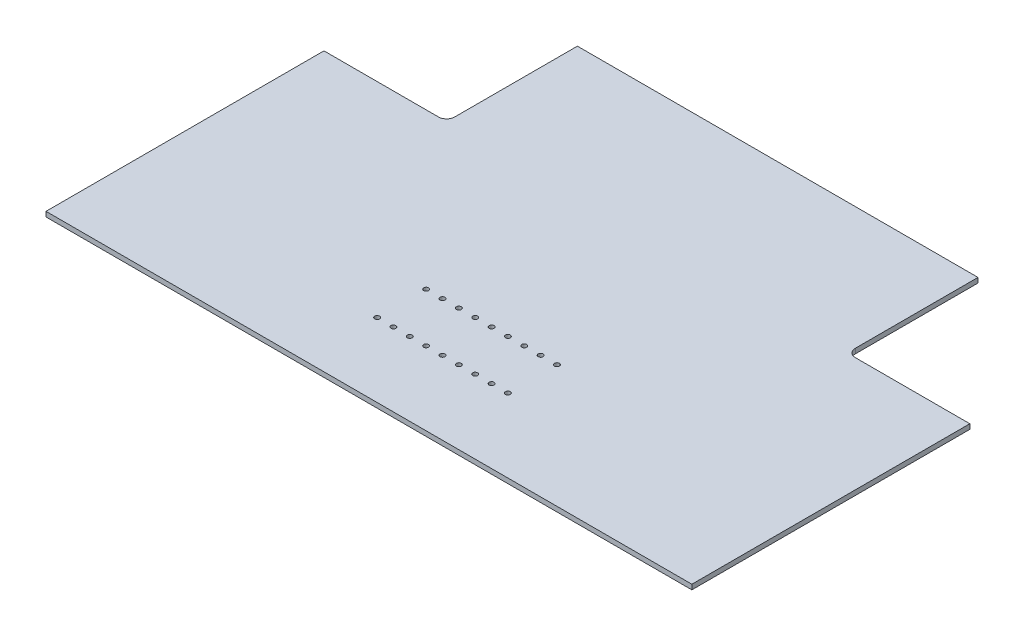
ISO-10303-21;
HEADER;
FILE_DESCRIPTION(('STEP AP214'),'2;1');
FILE_NAME('part.step','',(''),(''),'','','');
FILE_SCHEMA(('AUTOMOTIVE_DESIGN { 1 0 10303 214 1 1 1 1 }'));
ENDSEC;
DATA;
#1=APPLICATION_CONTEXT('core data for automotive mechanical design processes');
#2=APPLICATION_PROTOCOL_DEFINITION('international standard','automotive_design',2000,#1);
#3=PRODUCT_CONTEXT('',#1,'mechanical');
#4=PRODUCT('Part','Part','',(#3));
#5=PRODUCT_RELATED_PRODUCT_CATEGORY('part','',(#4));
#6=PRODUCT_DEFINITION_FORMATION('','',#4);
#7=PRODUCT_DEFINITION_CONTEXT('part definition',#1,'design');
#8=PRODUCT_DEFINITION('design','',#6,#7);
#9=PRODUCT_DEFINITION_SHAPE('','',#8);
#10=(LENGTH_UNIT() NAMED_UNIT(*) SI_UNIT(.MILLI.,.METRE.));
#11=(NAMED_UNIT(*) PLANE_ANGLE_UNIT() SI_UNIT($,.RADIAN.));
#12=(NAMED_UNIT(*) SI_UNIT($,.STERADIAN.) SOLID_ANGLE_UNIT());
#13=UNCERTAINTY_MEASURE_WITH_UNIT(LENGTH_MEASURE(1.E-05),#10,'distance_accuracy_value','');
#14=(GEOMETRIC_REPRESENTATION_CONTEXT(3) GLOBAL_UNCERTAINTY_ASSIGNED_CONTEXT((#13)) GLOBAL_UNIT_ASSIGNED_CONTEXT((#10,
#11,#12)) REPRESENTATION_CONTEXT('',''));
#15=CARTESIAN_POINT('',(0.,0.,0.));
#16=DIRECTION('',(0.,0.,1.));
#17=DIRECTION('',(1.,0.,0.));
#18=AXIS2_PLACEMENT_3D('',#15,#16,#17);
#19=CARTESIAN_POINT('',(197.5,3.,-125.));
#20=DIRECTION('',(-1.,0.,0.));
#21=DIRECTION('',(0.,0.,1.));
#22=AXIS2_PLACEMENT_3D('',#19,#20,#21);
#23=PLANE('',#22);
#24=DIRECTION('',(0.,1.,0.));
#25=VECTOR('',#24,1.);
#26=CARTESIAN_POINT('',(197.5,0.,-45.));
#27=LINE('',#26,#25);
#28=CARTESIAN_POINT('',(197.5,0.,-45.));
#29=VERTEX_POINT('',#28);
#30=CARTESIAN_POINT('',(197.5,3.,-45.));
#31=VERTEX_POINT('',#30);
#32=EDGE_CURVE('E137',#29,#31,#27,.T.);
#33=ORIENTED_EDGE('',*,*,#32,.T.);
#34=DIRECTION('',(0.,0.,-1.));
#35=VECTOR('',#34,1.);
#36=CARTESIAN_POINT('',(197.5,3.,-125.));
#37=LINE('',#36,#35);
#38=CARTESIAN_POINT('',(197.5,3.,125.));
#39=VERTEX_POINT('',#38);
#40=EDGE_CURVE('E158',#39,#31,#37,.T.);
#41=ORIENTED_EDGE('',*,*,#40,.F.);
#42=DIRECTION('',(0.,-1.,0.));
#43=VECTOR('',#42,1.);
#44=CARTESIAN_POINT('',(197.5,3.,125.));
#45=LINE('',#44,#43);
#46=CARTESIAN_POINT('',(197.5,0.,125.));
#47=VERTEX_POINT('',#46);
#48=EDGE_CURVE('E159',#39,#47,#45,.T.);
#49=ORIENTED_EDGE('',*,*,#48,.T.);
#50=DIRECTION('',(0.,0.,-1.));
#51=VECTOR('',#50,1.);
#52=CARTESIAN_POINT('',(197.5,0.,-125.));
#53=LINE('',#52,#51);
#54=EDGE_CURVE('E145',#47,#29,#53,.T.);
#55=ORIENTED_EDGE('',*,*,#54,.T.);
#56=EDGE_LOOP('',(#33,#41,#49,#55));
#57=FACE_BOUND('',#56,.T.);
#58=ADVANCED_FACE('F42',(#57),#23,.F.);
#59=CARTESIAN_POINT('',(-197.5,3.,-125.));
#60=DIRECTION('',(0.,0.,1.));
#61=DIRECTION('',(1.,0.,0.));
#62=AXIS2_PLACEMENT_3D('',#59,#60,#61);
#63=PLANE('',#62);
#64=DIRECTION('',(0.,1.,0.));
#65=VECTOR('',#64,1.);
#66=CARTESIAN_POINT('',(122.5,0.,-125.));
#67=LINE('',#66,#65);
#68=CARTESIAN_POINT('',(122.5,0.,-125.));
#69=VERTEX_POINT('',#68);
#70=CARTESIAN_POINT('',(122.5,3.,-125.));
#71=VERTEX_POINT('',#70);
#72=EDGE_CURVE('E119',#69,#71,#67,.T.);
#73=ORIENTED_EDGE('',*,*,#72,.F.);
#74=DIRECTION('',(-1.,0.,0.));
#75=VECTOR('',#74,1.);
#76=CARTESIAN_POINT('',(-197.5,0.,-125.));
#77=LINE('',#76,#75);
#78=CARTESIAN_POINT('',(-122.5,0.,-125.));
#79=VERTEX_POINT('',#78);
#80=EDGE_CURVE('E132',#69,#79,#77,.T.);
#81=ORIENTED_EDGE('',*,*,#80,.T.);
#82=DIRECTION('',(0.,1.,0.));
#83=VECTOR('',#82,1.);
#84=CARTESIAN_POINT('',(-122.5,0.,-125.));
#85=LINE('',#84,#83);
#86=CARTESIAN_POINT('',(-122.5,3.,-125.));
#87=VERTEX_POINT('',#86);
#88=EDGE_CURVE('E152',#79,#87,#85,.T.);
#89=ORIENTED_EDGE('',*,*,#88,.T.);
#90=DIRECTION('',(-1.,0.,0.));
#91=VECTOR('',#90,1.);
#92=CARTESIAN_POINT('',(-197.5,3.,-125.));
#93=LINE('',#92,#91);
#94=EDGE_CURVE('E135',#71,#87,#93,.T.);
#95=ORIENTED_EDGE('',*,*,#94,.F.);
#96=EDGE_LOOP('',(#73,#81,#89,#95));
#97=FACE_BOUND('',#96,.T.);
#98=ADVANCED_FACE('F130',(#97),#63,.F.);
#99=CARTESIAN_POINT('',(0.,3.,0.));
#100=DIRECTION('',(0.,1.,0.));
#101=DIRECTION('',(0.,0.,1.));
#102=AXIS2_PLACEMENT_3D('',#99,#100,#101);
#103=PLANE('',#102);
#104=CARTESIAN_POINT('',(10.,3.,80.));
#105=DIRECTION('',(0.,1.,0.));
#106=DIRECTION('',(0.,0.,1.));
#107=AXIS2_PLACEMENT_3D('',#104,#105,#106);
#108=CIRCLE('',#107,1.5);
#109=CARTESIAN_POINT('',(10.,3.,81.5));
#110=VERTEX_POINT('',#109);
#111=EDGE_CURVE('E337',#110,#110,#108,.T.);
#112=ORIENTED_EDGE('',*,*,#111,.F.);
#113=EDGE_LOOP('',(#112));
#114=FACE_BOUND('',#113,.T.);
#115=CARTESIAN_POINT('',(-40.,3.,80.));
#116=DIRECTION('',(0.,1.,0.));
#117=DIRECTION('',(0.,0.,1.));
#118=AXIS2_PLACEMENT_3D('',#115,#116,#117);
#119=CIRCLE('',#118,1.5);
#120=CARTESIAN_POINT('',(-40.,3.,81.5));
#121=VERTEX_POINT('',#120);
#122=EDGE_CURVE('E336',#121,#121,#119,.T.);
#123=ORIENTED_EDGE('',*,*,#122,.F.);
#124=EDGE_LOOP('',(#123));
#125=FACE_BOUND('',#124,.T.);
#126=CARTESIAN_POINT('',(-30.,3.,80.));
#127=DIRECTION('',(0.,1.,0.));
#128=DIRECTION('',(0.,0.,1.));
#129=AXIS2_PLACEMENT_3D('',#126,#127,#128);
#130=CIRCLE('',#129,1.5);
#131=CARTESIAN_POINT('',(-30.,3.,81.5));
#132=VERTEX_POINT('',#131);
#133=EDGE_CURVE('E321',#132,#132,#130,.T.);
#134=ORIENTED_EDGE('',*,*,#133,.F.);
#135=EDGE_LOOP('',(#134));
#136=FACE_BOUND('',#135,.T.);
#137=CARTESIAN_POINT('',(-20.,3.,80.));
#138=DIRECTION('',(0.,1.,0.));
#139=DIRECTION('',(0.,0.,1.));
#140=AXIS2_PLACEMENT_3D('',#137,#138,#139);
#141=CIRCLE('',#140,1.5);
#142=CARTESIAN_POINT('',(-20.,3.,81.5));
#143=VERTEX_POINT('',#142);
#144=EDGE_CURVE('E320',#143,#143,#141,.T.);
#145=ORIENTED_EDGE('',*,*,#144,.F.);
#146=EDGE_LOOP('',(#145));
#147=FACE_BOUND('',#146,.T.);
#148=CARTESIAN_POINT('',(20.,3.,80.));
#149=DIRECTION('',(0.,1.,0.));
#150=DIRECTION('',(0.,0.,1.));
#151=AXIS2_PLACEMENT_3D('',#148,#149,#150);
#152=CIRCLE('',#151,1.5);
#153=CARTESIAN_POINT('',(20.,3.,81.5));
#154=VERTEX_POINT('',#153);
#155=EDGE_CURVE('E361',#154,#154,#152,.T.);
#156=ORIENTED_EDGE('',*,*,#155,.F.);
#157=EDGE_LOOP('',(#156));
#158=FACE_BOUND('',#157,.T.);
#159=CARTESIAN_POINT('',(30.,3.,80.));
#160=DIRECTION('',(0.,1.,0.));
#161=DIRECTION('',(0.,0.,1.));
#162=AXIS2_PLACEMENT_3D('',#159,#160,#161);
#163=CIRCLE('',#162,1.5);
#164=CARTESIAN_POINT('',(30.,3.,81.5));
#165=VERTEX_POINT('',#164);
#166=EDGE_CURVE('E352',#165,#165,#163,.T.);
#167=ORIENTED_EDGE('',*,*,#166,.F.);
#168=EDGE_LOOP('',(#167));
#169=FACE_BOUND('',#168,.T.);
#170=CARTESIAN_POINT('',(40.,3.,80.));
#171=DIRECTION('',(0.,1.,0.));
#172=DIRECTION('',(0.,0.,1.));
#173=AXIS2_PLACEMENT_3D('',#170,#171,#172);
#174=CIRCLE('',#173,1.5);
#175=CARTESIAN_POINT('',(40.,3.,81.5));
#176=VERTEX_POINT('',#175);
#177=EDGE_CURVE('E353',#176,#176,#174,.T.);
#178=ORIENTED_EDGE('',*,*,#177,.F.);
#179=EDGE_LOOP('',(#178));
#180=FACE_BOUND('',#179,.T.);
#181=CARTESIAN_POINT('',(-10.,3.,80.));
#182=DIRECTION('',(0.,1.,0.));
#183=DIRECTION('',(0.,0.,1.));
#184=AXIS2_PLACEMENT_3D('',#181,#182,#183);
#185=CIRCLE('',#184,1.5);
#186=CARTESIAN_POINT('',(-10.,3.,81.5));
#187=VERTEX_POINT('',#186);
#188=EDGE_CURVE('E311',#187,#187,#185,.T.);
#189=ORIENTED_EDGE('',*,*,#188,.F.);
#190=EDGE_LOOP('',(#189));
#191=FACE_BOUND('',#190,.T.);
#192=CARTESIAN_POINT('',(10.,3.,50.));
#193=DIRECTION('',(0.,1.,0.));
#194=DIRECTION('',(0.,0.,1.));
#195=AXIS2_PLACEMENT_3D('',#192,#193,#194);
#196=CIRCLE('',#195,1.5);
#197=CARTESIAN_POINT('',(10.,3.,51.5));
#198=VERTEX_POINT('',#197);
#199=EDGE_CURVE('E273',#198,#198,#196,.T.);
#200=ORIENTED_EDGE('',*,*,#199,.F.);
#201=EDGE_LOOP('',(#200));
#202=FACE_BOUND('',#201,.T.);
#203=CARTESIAN_POINT('',(-40.,3.,50.));
#204=DIRECTION('',(0.,1.,0.));
#205=DIRECTION('',(0.,0.,1.));
#206=AXIS2_PLACEMENT_3D('',#203,#204,#205);
#207=CIRCLE('',#206,1.5);
#208=CARTESIAN_POINT('',(-40.,3.,51.5));
#209=VERTEX_POINT('',#208);
#210=EDGE_CURVE('E272',#209,#209,#207,.T.);
#211=ORIENTED_EDGE('',*,*,#210,.F.);
#212=EDGE_LOOP('',(#211));
#213=FACE_BOUND('',#212,.T.);
#214=CARTESIAN_POINT('',(-30.,3.,50.));
#215=DIRECTION('',(0.,1.,0.));
#216=DIRECTION('',(0.,0.,1.));
#217=AXIS2_PLACEMENT_3D('',#214,#215,#216);
#218=CIRCLE('',#217,1.5);
#219=CARTESIAN_POINT('',(-30.,3.,51.5));
#220=VERTEX_POINT('',#219);
#221=EDGE_CURVE('E257',#220,#220,#218,.T.);
#222=ORIENTED_EDGE('',*,*,#221,.F.);
#223=EDGE_LOOP('',(#222));
#224=FACE_BOUND('',#223,.T.);
#225=CARTESIAN_POINT('',(-20.,3.,50.));
#226=DIRECTION('',(0.,1.,0.));
#227=DIRECTION('',(0.,0.,1.));
#228=AXIS2_PLACEMENT_3D('',#225,#226,#227);
#229=CIRCLE('',#228,1.5);
#230=CARTESIAN_POINT('',(-20.,3.,51.5));
#231=VERTEX_POINT('',#230);
#232=EDGE_CURVE('E256',#231,#231,#229,.T.);
#233=ORIENTED_EDGE('',*,*,#232,.F.);
#234=EDGE_LOOP('',(#233));
#235=FACE_BOUND('',#234,.T.);
#236=CARTESIAN_POINT('',(20.,3.,50.));
#237=DIRECTION('',(0.,1.,0.));
#238=DIRECTION('',(0.,0.,1.));
#239=AXIS2_PLACEMENT_3D('',#236,#237,#238);
#240=CIRCLE('',#239,1.5);
#241=CARTESIAN_POINT('',(20.,3.,51.5));
#242=VERTEX_POINT('',#241);
#243=EDGE_CURVE('E298',#242,#242,#240,.T.);
#244=ORIENTED_EDGE('',*,*,#243,.F.);
#245=EDGE_LOOP('',(#244));
#246=FACE_BOUND('',#245,.T.);
#247=CARTESIAN_POINT('',(30.,3.,50.));
#248=DIRECTION('',(0.,1.,0.));
#249=DIRECTION('',(0.,0.,1.));
#250=AXIS2_PLACEMENT_3D('',#247,#248,#249);
#251=CIRCLE('',#250,1.5);
#252=CARTESIAN_POINT('',(30.,3.,51.5));
#253=VERTEX_POINT('',#252);
#254=EDGE_CURVE('E288',#253,#253,#251,.T.);
#255=ORIENTED_EDGE('',*,*,#254,.F.);
#256=EDGE_LOOP('',(#255));
#257=FACE_BOUND('',#256,.T.);
#258=CARTESIAN_POINT('',(40.,3.,50.));
#259=DIRECTION('',(0.,1.,0.));
#260=DIRECTION('',(0.,0.,1.));
#261=AXIS2_PLACEMENT_3D('',#258,#259,#260);
#262=CIRCLE('',#261,1.5);
#263=CARTESIAN_POINT('',(40.,3.,51.5));
#264=VERTEX_POINT('',#263);
#265=EDGE_CURVE('E289',#264,#264,#262,.T.);
#266=ORIENTED_EDGE('',*,*,#265,.F.);
#267=EDGE_LOOP('',(#266));
#268=FACE_BOUND('',#267,.T.);
#269=CARTESIAN_POINT('',(-10.,3.,50.));
#270=DIRECTION('',(0.,1.,0.));
#271=DIRECTION('',(0.,0.,1.));
#272=AXIS2_PLACEMENT_3D('',#269,#270,#271);
#273=CIRCLE('',#272,1.5);
#274=CARTESIAN_POINT('',(-10.,3.,51.5));
#275=VERTEX_POINT('',#274);
#276=EDGE_CURVE('E247',#275,#275,#273,.T.);
#277=ORIENTED_EDGE('',*,*,#276,.F.);
#278=EDGE_LOOP('',(#277));
#279=FACE_BOUND('',#278,.T.);
#280=CARTESIAN_POINT('',(0.,3.,50.));
#281=DIRECTION('',(0.,1.,0.));
#282=DIRECTION('',(0.,0.,1.));
#283=AXIS2_PLACEMENT_3D('',#280,#281,#282);
#284=CIRCLE('',#283,1.5);
#285=CARTESIAN_POINT('',(0.,3.,51.5));
#286=VERTEX_POINT('',#285);
#287=EDGE_CURVE('E174',#286,#286,#284,.T.);
#288=ORIENTED_EDGE('',*,*,#287,.F.);
#289=EDGE_LOOP('',(#288));
#290=FACE_BOUND('',#289,.T.);
#291=CARTESIAN_POINT('',(0.,3.,80.));
#292=DIRECTION('',(0.,1.,0.));
#293=DIRECTION('',(0.,0.,1.));
#294=AXIS2_PLACEMENT_3D('',#291,#292,#293);
#295=CIRCLE('',#294,1.5);
#296=CARTESIAN_POINT('',(0.,3.,81.5));
#297=VERTEX_POINT('',#296);
#298=EDGE_CURVE('E236',#297,#297,#295,.T.);
#299=ORIENTED_EDGE('',*,*,#298,.F.);
#300=EDGE_LOOP('',(#299));
#301=FACE_BOUND('',#300,.T.);
#302=ORIENTED_EDGE('',*,*,#40,.T.);
#303=DIRECTION('',(-1.,0.,0.));
#304=VECTOR('',#303,1.);
#305=CARTESIAN_POINT('',(197.5,3.,-45.));
#306=LINE('',#305,#304);
#307=CARTESIAN_POINT('',(127.5,3.,-45.));
#308=VERTEX_POINT('',#307);
#309=EDGE_CURVE('E126',#31,#308,#306,.T.);
#310=ORIENTED_EDGE('',*,*,#309,.T.);
#311=CARTESIAN_POINT('',(127.5,3.,-50.));
#312=DIRECTION('',(0.,1.,0.));
#313=DIRECTION('',(0.,0.,1.));
#314=AXIS2_PLACEMENT_3D('',#311,#312,#313);
#315=CIRCLE('',#314,5.);
#316=CARTESIAN_POINT('',(122.5,3.,-50.));
#317=VERTEX_POINT('',#316);
#318=EDGE_CURVE('E51',#308,#317,#315,.F.);
#319=ORIENTED_EDGE('',*,*,#318,.T.);
#320=DIRECTION('',(0.,0.,-1.));
#321=VECTOR('',#320,1.);
#322=CARTESIAN_POINT('',(122.5,3.,-125.));
#323=LINE('',#322,#321);
#324=EDGE_CURVE('E178',#317,#71,#323,.T.);
#325=ORIENTED_EDGE('',*,*,#324,.T.);
#326=ORIENTED_EDGE('',*,*,#94,.T.);
#327=DIRECTION('',(0.,0.,-1.));
#328=VECTOR('',#327,1.);
#329=CARTESIAN_POINT('',(-122.5,3.,-125.));
#330=LINE('',#329,#328);
#331=CARTESIAN_POINT('',(-122.5,3.,-50.));
#332=VERTEX_POINT('',#331);
#333=EDGE_CURVE('E213',#332,#87,#330,.T.);
#334=ORIENTED_EDGE('',*,*,#333,.F.);
#335=CARTESIAN_POINT('',(-127.5,3.,-50.));
#336=DIRECTION('',(0.,1.,0.));
#337=DIRECTION('',(0.,0.,1.));
#338=AXIS2_PLACEMENT_3D('',#335,#336,#337);
#339=CIRCLE('',#338,5.);
#340=CARTESIAN_POINT('',(-127.5,3.,-45.));
#341=VERTEX_POINT('',#340);
#342=EDGE_CURVE('E191',#332,#341,#339,.F.);
#343=ORIENTED_EDGE('',*,*,#342,.T.);
#344=DIRECTION('',(1.,0.,0.));
#345=VECTOR('',#344,1.);
#346=CARTESIAN_POINT('',(-197.5,3.,-45.));
#347=LINE('',#346,#345);
#348=CARTESIAN_POINT('',(-197.5,3.,-45.));
#349=VERTEX_POINT('',#348);
#350=EDGE_CURVE('E217',#349,#341,#347,.T.);
#351=ORIENTED_EDGE('',*,*,#350,.F.);
#352=DIRECTION('',(0.,0.,1.));
#353=VECTOR('',#352,1.);
#354=CARTESIAN_POINT('',(-197.5,3.,-125.));
#355=LINE('',#354,#353);
#356=CARTESIAN_POINT('',(-197.5,3.,125.));
#357=VERTEX_POINT('',#356);
#358=EDGE_CURVE('E199',#349,#357,#355,.T.);
#359=ORIENTED_EDGE('',*,*,#358,.T.);
#360=DIRECTION('',(1.,0.,0.));
#361=VECTOR('',#360,1.);
#362=CARTESIAN_POINT('',(-197.5,3.,125.));
#363=LINE('',#362,#361);
#364=EDGE_CURVE('E164',#357,#39,#363,.T.);
#365=ORIENTED_EDGE('',*,*,#364,.T.);
#366=EDGE_LOOP('',(#302,#310,#319,#325,#326,#334,#343,#351,#359,#365));
#367=FACE_BOUND('',#366,.T.);
#368=ADVANCED_FACE('F375',(#114,#125,#136,#147,#158,#169,#180,#191,#202,#213,#224,#235,#246,
#257,#268,#279,#290,#301,#367),#103,.T.);
#369=CARTESIAN_POINT('',(0.,0.,0.));
#370=DIRECTION('',(0.,1.,0.));
#371=DIRECTION('',(0.,0.,1.));
#372=AXIS2_PLACEMENT_3D('',#369,#370,#371);
#373=PLANE('',#372);
#374=CARTESIAN_POINT('',(10.,0.,80.));
#375=DIRECTION('',(0.,1.,0.));
#376=DIRECTION('',(0.,0.,1.));
#377=AXIS2_PLACEMENT_3D('',#374,#375,#376);
#378=CIRCLE('',#377,1.5);
#379=CARTESIAN_POINT('',(10.,0.,81.5));
#380=VERTEX_POINT('',#379);
#381=EDGE_CURVE('E332',#380,#380,#378,.T.);
#382=ORIENTED_EDGE('',*,*,#381,.T.);
#383=EDGE_LOOP('',(#382));
#384=FACE_BOUND('',#383,.T.);
#385=CARTESIAN_POINT('',(-40.,0.,80.));
#386=DIRECTION('',(0.,1.,0.));
#387=DIRECTION('',(0.,0.,1.));
#388=AXIS2_PLACEMENT_3D('',#385,#386,#387);
#389=CIRCLE('',#388,1.5);
#390=CARTESIAN_POINT('',(-40.,0.,81.5));
#391=VERTEX_POINT('',#390);
#392=EDGE_CURVE('E325',#391,#391,#389,.T.);
#393=ORIENTED_EDGE('',*,*,#392,.T.);
#394=EDGE_LOOP('',(#393));
#395=FACE_BOUND('',#394,.T.);
#396=CARTESIAN_POINT('',(-30.,0.,80.));
#397=DIRECTION('',(0.,1.,0.));
#398=DIRECTION('',(0.,0.,1.));
#399=AXIS2_PLACEMENT_3D('',#396,#397,#398);
#400=CIRCLE('',#399,1.5);
#401=CARTESIAN_POINT('',(-30.,0.,81.5));
#402=VERTEX_POINT('',#401);
#403=EDGE_CURVE('E316',#402,#402,#400,.T.);
#404=ORIENTED_EDGE('',*,*,#403,.T.);
#405=EDGE_LOOP('',(#404));
#406=FACE_BOUND('',#405,.T.);
#407=CARTESIAN_POINT('',(-20.,0.,80.));
#408=DIRECTION('',(0.,1.,0.));
#409=DIRECTION('',(0.,0.,1.));
#410=AXIS2_PLACEMENT_3D('',#407,#408,#409);
#411=CIRCLE('',#410,1.5);
#412=CARTESIAN_POINT('',(-20.,0.,81.5));
#413=VERTEX_POINT('',#412);
#414=EDGE_CURVE('E315',#413,#413,#411,.T.);
#415=ORIENTED_EDGE('',*,*,#414,.T.);
#416=EDGE_LOOP('',(#415));
#417=FACE_BOUND('',#416,.T.);
#418=CARTESIAN_POINT('',(20.,0.,80.));
#419=DIRECTION('',(0.,1.,0.));
#420=DIRECTION('',(0.,0.,1.));
#421=AXIS2_PLACEMENT_3D('',#418,#419,#420);
#422=CIRCLE('',#421,1.5);
#423=CARTESIAN_POINT('',(20.,0.,81.5));
#424=VERTEX_POINT('',#423);
#425=EDGE_CURVE('E341',#424,#424,#422,.T.);
#426=ORIENTED_EDGE('',*,*,#425,.T.);
#427=EDGE_LOOP('',(#426));
#428=FACE_BOUND('',#427,.T.);
#429=CARTESIAN_POINT('',(30.,0.,80.));
#430=DIRECTION('',(0.,1.,0.));
#431=DIRECTION('',(0.,0.,1.));
#432=AXIS2_PLACEMENT_3D('',#429,#430,#431);
#433=CIRCLE('',#432,1.5);
#434=CARTESIAN_POINT('',(30.,0.,81.5));
#435=VERTEX_POINT('',#434);
#436=EDGE_CURVE('E357',#435,#435,#433,.T.);
#437=ORIENTED_EDGE('',*,*,#436,.T.);
#438=EDGE_LOOP('',(#437));
#439=FACE_BOUND('',#438,.T.);
#440=CARTESIAN_POINT('',(40.,0.,80.));
#441=DIRECTION('',(0.,1.,0.));
#442=DIRECTION('',(0.,0.,1.));
#443=AXIS2_PLACEMENT_3D('',#440,#441,#442);
#444=CIRCLE('',#443,1.5);
#445=CARTESIAN_POINT('',(40.,0.,81.5));
#446=VERTEX_POINT('',#445);
#447=EDGE_CURVE('E348',#446,#446,#444,.T.);
#448=ORIENTED_EDGE('',*,*,#447,.T.);
#449=EDGE_LOOP('',(#448));
#450=FACE_BOUND('',#449,.T.);
#451=CARTESIAN_POINT('',(-10.,0.,80.));
#452=DIRECTION('',(0.,1.,0.));
#453=DIRECTION('',(0.,0.,1.));
#454=AXIS2_PLACEMENT_3D('',#451,#452,#453);
#455=CIRCLE('',#454,1.5);
#456=CARTESIAN_POINT('',(-10.,0.,81.5));
#457=VERTEX_POINT('',#456);
#458=EDGE_CURVE('E293',#457,#457,#455,.T.);
#459=ORIENTED_EDGE('',*,*,#458,.T.);
#460=EDGE_LOOP('',(#459));
#461=FACE_BOUND('',#460,.T.);
#462=CARTESIAN_POINT('',(10.,0.,50.));
#463=DIRECTION('',(0.,1.,0.));
#464=DIRECTION('',(0.,0.,1.));
#465=AXIS2_PLACEMENT_3D('',#462,#463,#464);
#466=CIRCLE('',#465,1.5);
#467=CARTESIAN_POINT('',(10.,0.,51.5));
#468=VERTEX_POINT('',#467);
#469=EDGE_CURVE('E268',#468,#468,#466,.T.);
#470=ORIENTED_EDGE('',*,*,#469,.T.);
#471=EDGE_LOOP('',(#470));
#472=FACE_BOUND('',#471,.T.);
#473=CARTESIAN_POINT('',(-40.,0.,50.));
#474=DIRECTION('',(0.,1.,0.));
#475=DIRECTION('',(0.,0.,1.));
#476=AXIS2_PLACEMENT_3D('',#473,#474,#475);
#477=CIRCLE('',#476,1.5);
#478=CARTESIAN_POINT('',(-40.,0.,51.5));
#479=VERTEX_POINT('',#478);
#480=EDGE_CURVE('E261',#479,#479,#477,.T.);
#481=ORIENTED_EDGE('',*,*,#480,.T.);
#482=EDGE_LOOP('',(#481));
#483=FACE_BOUND('',#482,.T.);
#484=CARTESIAN_POINT('',(-30.,0.,50.));
#485=DIRECTION('',(0.,1.,0.));
#486=DIRECTION('',(0.,0.,1.));
#487=AXIS2_PLACEMENT_3D('',#484,#485,#486);
#488=CIRCLE('',#487,1.5);
#489=CARTESIAN_POINT('',(-30.,0.,51.5));
#490=VERTEX_POINT('',#489);
#491=EDGE_CURVE('E252',#490,#490,#488,.T.);
#492=ORIENTED_EDGE('',*,*,#491,.T.);
#493=EDGE_LOOP('',(#492));
#494=FACE_BOUND('',#493,.T.);
#495=CARTESIAN_POINT('',(-20.,0.,50.));
#496=DIRECTION('',(0.,1.,0.));
#497=DIRECTION('',(0.,0.,1.));
#498=AXIS2_PLACEMENT_3D('',#495,#496,#497);
#499=CIRCLE('',#498,1.5);
#500=CARTESIAN_POINT('',(-20.,0.,51.5));
#501=VERTEX_POINT('',#500);
#502=EDGE_CURVE('E251',#501,#501,#499,.T.);
#503=ORIENTED_EDGE('',*,*,#502,.T.);
#504=EDGE_LOOP('',(#503));
#505=FACE_BOUND('',#504,.T.);
#506=CARTESIAN_POINT('',(20.,0.,50.));
#507=DIRECTION('',(0.,1.,0.));
#508=DIRECTION('',(0.,0.,1.));
#509=AXIS2_PLACEMENT_3D('',#506,#507,#508);
#510=CIRCLE('',#509,1.5);
#511=CARTESIAN_POINT('',(20.,0.,51.5));
#512=VERTEX_POINT('',#511);
#513=EDGE_CURVE('E277',#512,#512,#510,.T.);
#514=ORIENTED_EDGE('',*,*,#513,.T.);
#515=EDGE_LOOP('',(#514));
#516=FACE_BOUND('',#515,.T.);
#517=CARTESIAN_POINT('',(30.,0.,50.));
#518=DIRECTION('',(0.,1.,0.));
#519=DIRECTION('',(0.,0.,1.));
#520=AXIS2_PLACEMENT_3D('',#517,#518,#519);
#521=CIRCLE('',#520,1.5);
#522=CARTESIAN_POINT('',(30.,0.,51.5));
#523=VERTEX_POINT('',#522);
#524=EDGE_CURVE('E294',#523,#523,#521,.T.);
#525=ORIENTED_EDGE('',*,*,#524,.T.);
#526=EDGE_LOOP('',(#525));
#527=FACE_BOUND('',#526,.T.);
#528=CARTESIAN_POINT('',(40.,0.,50.));
#529=DIRECTION('',(0.,1.,0.));
#530=DIRECTION('',(0.,0.,1.));
#531=AXIS2_PLACEMENT_3D('',#528,#529,#530);
#532=CIRCLE('',#531,1.5);
#533=CARTESIAN_POINT('',(40.,0.,51.5));
#534=VERTEX_POINT('',#533);
#535=EDGE_CURVE('E284',#534,#534,#532,.T.);
#536=ORIENTED_EDGE('',*,*,#535,.T.);
#537=EDGE_LOOP('',(#536));
#538=FACE_BOUND('',#537,.T.);
#539=CARTESIAN_POINT('',(-10.,0.,50.));
#540=DIRECTION('',(0.,1.,0.));
#541=DIRECTION('',(0.,0.,1.));
#542=AXIS2_PLACEMENT_3D('',#539,#540,#541);
#543=CIRCLE('',#542,1.5);
#544=CARTESIAN_POINT('',(-10.,0.,51.5));
#545=VERTEX_POINT('',#544);
#546=EDGE_CURVE('E240',#545,#545,#543,.T.);
#547=ORIENTED_EDGE('',*,*,#546,.T.);
#548=EDGE_LOOP('',(#547));
#549=FACE_BOUND('',#548,.T.);
#550=CARTESIAN_POINT('',(0.,0.,50.));
#551=DIRECTION('',(0.,1.,0.));
#552=DIRECTION('',(0.,0.,1.));
#553=AXIS2_PLACEMENT_3D('',#550,#551,#552);
#554=CIRCLE('',#553,1.5);
#555=CARTESIAN_POINT('',(0.,0.,51.5));
#556=VERTEX_POINT('',#555);
#557=EDGE_CURVE('E173',#556,#556,#554,.T.);
#558=ORIENTED_EDGE('',*,*,#557,.T.);
#559=EDGE_LOOP('',(#558));
#560=FACE_BOUND('',#559,.T.);
#561=CARTESIAN_POINT('',(0.,0.,80.));
#562=DIRECTION('',(0.,1.,0.));
#563=DIRECTION('',(0.,0.,1.));
#564=AXIS2_PLACEMENT_3D('',#561,#562,#563);
#565=CIRCLE('',#564,1.5);
#566=CARTESIAN_POINT('',(0.,0.,81.5));
#567=VERTEX_POINT('',#566);
#568=EDGE_CURVE('E169',#567,#567,#565,.T.);
#569=ORIENTED_EDGE('',*,*,#568,.T.);
#570=EDGE_LOOP('',(#569));
#571=FACE_BOUND('',#570,.T.);
#572=DIRECTION('',(-1.,0.,0.));
#573=VECTOR('',#572,1.);
#574=CARTESIAN_POINT('',(197.5,0.,-45.));
#575=LINE('',#574,#573);
#576=CARTESIAN_POINT('',(127.5,0.,-45.));
#577=VERTEX_POINT('',#576);
#578=EDGE_CURVE('E125',#29,#577,#575,.T.);
#579=ORIENTED_EDGE('',*,*,#578,.F.);
#580=ORIENTED_EDGE('',*,*,#54,.F.);
#581=DIRECTION('',(1.,0.,0.));
#582=VECTOR('',#581,1.);
#583=CARTESIAN_POINT('',(-197.5,0.,125.));
#584=LINE('',#583,#582);
#585=CARTESIAN_POINT('',(-197.5,0.,125.));
#586=VERTEX_POINT('',#585);
#587=EDGE_CURVE('E149',#586,#47,#584,.T.);
#588=ORIENTED_EDGE('',*,*,#587,.F.);
#589=DIRECTION('',(0.,0.,1.));
#590=VECTOR('',#589,1.);
#591=CARTESIAN_POINT('',(-197.5,0.,-125.));
#592=LINE('',#591,#590);
#593=CARTESIAN_POINT('',(-197.5,0.,-45.));
#594=VERTEX_POINT('',#593);
#595=EDGE_CURVE('E144',#594,#586,#592,.T.);
#596=ORIENTED_EDGE('',*,*,#595,.F.);
#597=DIRECTION('',(1.,0.,0.));
#598=VECTOR('',#597,1.);
#599=CARTESIAN_POINT('',(-197.5,0.,-45.));
#600=LINE('',#599,#598);
#601=CARTESIAN_POINT('',(-127.5,0.,-45.));
#602=VERTEX_POINT('',#601);
#603=EDGE_CURVE('E216',#594,#602,#600,.T.);
#604=ORIENTED_EDGE('',*,*,#603,.T.);
#605=CARTESIAN_POINT('',(-127.5,0.,-50.));
#606=DIRECTION('',(0.,1.,0.));
#607=DIRECTION('',(0.,0.,1.));
#608=AXIS2_PLACEMENT_3D('',#605,#606,#607);
#609=CIRCLE('',#608,5.);
#610=CARTESIAN_POINT('',(-122.5,0.,-50.));
#611=VERTEX_POINT('',#610);
#612=EDGE_CURVE('E194',#602,#611,#609,.T.);
#613=ORIENTED_EDGE('',*,*,#612,.T.);
#614=DIRECTION('',(0.,0.,-1.));
#615=VECTOR('',#614,1.);
#616=CARTESIAN_POINT('',(-122.5,0.,-125.));
#617=LINE('',#616,#615);
#618=EDGE_CURVE('E142',#611,#79,#617,.T.);
#619=ORIENTED_EDGE('',*,*,#618,.T.);
#620=ORIENTED_EDGE('',*,*,#80,.F.);
#621=DIRECTION('',(0.,0.,-1.));
#622=VECTOR('',#621,1.);
#623=CARTESIAN_POINT('',(122.5,0.,-125.));
#624=LINE('',#623,#622);
#625=CARTESIAN_POINT('',(122.5,0.,-50.));
#626=VERTEX_POINT('',#625);
#627=EDGE_CURVE('E116',#626,#69,#624,.T.);
#628=ORIENTED_EDGE('',*,*,#627,.F.);
#629=CARTESIAN_POINT('',(127.5,0.,-50.));
#630=DIRECTION('',(0.,1.,0.));
#631=DIRECTION('',(0.,0.,1.));
#632=AXIS2_PLACEMENT_3D('',#629,#630,#631);
#633=CIRCLE('',#632,5.);
#634=EDGE_CURVE('E11',#626,#577,#633,.T.);
#635=ORIENTED_EDGE('',*,*,#634,.T.);
#636=EDGE_LOOP('',(#579,#580,#588,#596,#604,#613,#619,#620,#628,#635));
#637=FACE_BOUND('',#636,.T.);
#638=ADVANCED_FACE('F140',(#384,#395,#406,#417,#428,#439,#450,#461,#472,#483,#494,#505,#516,
#527,#538,#549,#560,#571,#637),#373,.F.);
#639=CARTESIAN_POINT('',(-197.5,3.,-125.));
#640=DIRECTION('',(1.,0.,0.));
#641=DIRECTION('',(0.,0.,-1.));
#642=AXIS2_PLACEMENT_3D('',#639,#640,#641);
#643=PLANE('',#642);
#644=ORIENTED_EDGE('',*,*,#358,.F.);
#645=DIRECTION('',(0.,1.,0.));
#646=VECTOR('',#645,1.);
#647=CARTESIAN_POINT('',(-197.5,0.,-45.));
#648=LINE('',#647,#646);
#649=EDGE_CURVE('E208',#594,#349,#648,.T.);
#650=ORIENTED_EDGE('',*,*,#649,.F.);
#651=ORIENTED_EDGE('',*,*,#595,.T.);
#652=DIRECTION('',(0.,-1.,0.));
#653=VECTOR('',#652,1.);
#654=CARTESIAN_POINT('',(-197.5,3.,125.));
#655=LINE('',#654,#653);
#656=EDGE_CURVE('E163',#357,#586,#655,.T.);
#657=ORIENTED_EDGE('',*,*,#656,.F.);
#658=EDGE_LOOP('',(#644,#650,#651,#657));
#659=FACE_BOUND('',#658,.T.);
#660=ADVANCED_FACE('F414',(#659),#643,.F.);
#661=CARTESIAN_POINT('',(-197.5,3.,125.));
#662=DIRECTION('',(0.,0.,-1.));
#663=DIRECTION('',(-1.,0.,0.));
#664=AXIS2_PLACEMENT_3D('',#661,#662,#663);
#665=PLANE('',#664);
#666=ORIENTED_EDGE('',*,*,#587,.T.);
#667=ORIENTED_EDGE('',*,*,#48,.F.);
#668=ORIENTED_EDGE('',*,*,#364,.F.);
#669=ORIENTED_EDGE('',*,*,#656,.T.);
#670=EDGE_LOOP('',(#666,#667,#668,#669));
#671=FACE_BOUND('',#670,.T.);
#672=ADVANCED_FACE('F421',(#671),#665,.F.);
#673=CARTESIAN_POINT('',(-122.5,0.,-125.));
#674=DIRECTION('',(1.,0.,0.));
#675=DIRECTION('',(0.,0.,-1.));
#676=AXIS2_PLACEMENT_3D('',#673,#674,#675);
#677=PLANE('',#676);
#678=ORIENTED_EDGE('',*,*,#618,.F.);
#679=DIRECTION('',(0.,1.,0.));
#680=VECTOR('',#679,1.);
#681=CARTESIAN_POINT('',(-122.5,3.,-50.));
#682=LINE('',#681,#680);
#683=EDGE_CURVE('E168',#611,#332,#682,.T.);
#684=ORIENTED_EDGE('',*,*,#683,.T.);
#685=ORIENTED_EDGE('',*,*,#333,.T.);
#686=ORIENTED_EDGE('',*,*,#88,.F.);
#687=EDGE_LOOP('',(#678,#684,#685,#686));
#688=FACE_BOUND('',#687,.T.);
#689=ADVANCED_FACE('F449',(#688),#677,.F.);
#690=CARTESIAN_POINT('',(-197.5,0.,-45.));
#691=DIRECTION('',(0.,0.,1.));
#692=DIRECTION('',(1.,0.,0.));
#693=AXIS2_PLACEMENT_3D('',#690,#691,#692);
#694=PLANE('',#693);
#695=ORIENTED_EDGE('',*,*,#350,.T.);
#696=DIRECTION('',(0.,1.,0.));
#697=VECTOR('',#696,1.);
#698=CARTESIAN_POINT('',(-127.5,0.,-45.));
#699=LINE('',#698,#697);
#700=EDGE_CURVE('E182',#341,#602,#699,.F.);
#701=ORIENTED_EDGE('',*,*,#700,.T.);
#702=ORIENTED_EDGE('',*,*,#603,.F.);
#703=ORIENTED_EDGE('',*,*,#649,.T.);
#704=EDGE_LOOP('',(#695,#701,#702,#703));
#705=FACE_BOUND('',#704,.T.);
#706=ADVANCED_FACE('F464',(#705),#694,.F.);
#707=CARTESIAN_POINT('',(197.5,0.,-45.));
#708=DIRECTION('',(0.,0.,-1.));
#709=DIRECTION('',(-1.,0.,0.));
#710=AXIS2_PLACEMENT_3D('',#707,#708,#709);
#711=PLANE('',#710);
#712=ORIENTED_EDGE('',*,*,#578,.T.);
#713=DIRECTION('',(0.,1.,0.));
#714=VECTOR('',#713,1.);
#715=CARTESIAN_POINT('',(127.5,3.,-45.));
#716=LINE('',#715,#714);
#717=EDGE_CURVE('E185',#577,#308,#716,.T.);
#718=ORIENTED_EDGE('',*,*,#717,.T.);
#719=ORIENTED_EDGE('',*,*,#309,.F.);
#720=ORIENTED_EDGE('',*,*,#32,.F.);
#721=EDGE_LOOP('',(#712,#718,#719,#720));
#722=FACE_BOUND('',#721,.T.);
#723=ADVANCED_FACE('F454',(#722),#711,.T.);
#724=CARTESIAN_POINT('',(122.5,0.,-125.));
#725=DIRECTION('',(1.,0.,0.));
#726=DIRECTION('',(0.,0.,-1.));
#727=AXIS2_PLACEMENT_3D('',#724,#725,#726);
#728=PLANE('',#727);
#729=ORIENTED_EDGE('',*,*,#324,.F.);
#730=DIRECTION('',(0.,1.,0.));
#731=VECTOR('',#730,1.);
#732=CARTESIAN_POINT('',(122.5,0.,-50.));
#733=LINE('',#732,#731);
#734=EDGE_CURVE('E58',#317,#626,#733,.F.);
#735=ORIENTED_EDGE('',*,*,#734,.T.);
#736=ORIENTED_EDGE('',*,*,#627,.T.);
#737=ORIENTED_EDGE('',*,*,#72,.T.);
#738=EDGE_LOOP('',(#729,#735,#736,#737));
#739=FACE_BOUND('',#738,.T.);
#740=ADVANCED_FACE('F118',(#739),#728,.T.);
#741=CARTESIAN_POINT('',(0.,-7.,80.));
#742=DIRECTION('',(0.,1.,0.));
#743=DIRECTION('',(0.,0.,1.));
#744=AXIS2_PLACEMENT_3D('',#741,#742,#743);
#745=CYLINDRICAL_SURFACE('',#744,1.5);
#746=ORIENTED_EDGE('',*,*,#298,.T.);
#747=EDGE_LOOP('',(#746));
#748=FACE_BOUND('',#747,.T.);
#749=ORIENTED_EDGE('',*,*,#568,.F.);
#750=EDGE_LOOP('',(#749));
#751=FACE_BOUND('',#750,.T.);
#752=ADVANCED_FACE('F406',(#748,#751),#745,.F.);
#753=CARTESIAN_POINT('',(0.,-7.,50.));
#754=DIRECTION('',(0.,1.,0.));
#755=DIRECTION('',(0.,0.,1.));
#756=AXIS2_PLACEMENT_3D('',#753,#754,#755);
#757=CYLINDRICAL_SURFACE('',#756,1.5);
#758=ORIENTED_EDGE('',*,*,#287,.T.);
#759=EDGE_LOOP('',(#758));
#760=FACE_BOUND('',#759,.T.);
#761=ORIENTED_EDGE('',*,*,#557,.F.);
#762=EDGE_LOOP('',(#761));
#763=FACE_BOUND('',#762,.T.);
#764=ADVANCED_FACE('F409',(#760,#763),#757,.F.);
#765=CARTESIAN_POINT('',(-127.5,0.,-50.));
#766=DIRECTION('',(0.,-1.,0.));
#767=DIRECTION('',(0.,0.,-1.));
#768=AXIS2_PLACEMENT_3D('',#765,#766,#767);
#769=CYLINDRICAL_SURFACE('',#768,5.);
#770=ORIENTED_EDGE('',*,*,#612,.F.);
#771=ORIENTED_EDGE('',*,*,#700,.F.);
#772=ORIENTED_EDGE('',*,*,#342,.F.);
#773=ORIENTED_EDGE('',*,*,#683,.F.);
#774=EDGE_LOOP('',(#770,#771,#772,#773));
#775=FACE_BOUND('',#774,.T.);
#776=ADVANCED_FACE('F433',(#775),#769,.F.);
#777=CARTESIAN_POINT('',(127.5,0.,-50.));
#778=DIRECTION('',(0.,-1.,0.));
#779=DIRECTION('',(0.,0.,-1.));
#780=AXIS2_PLACEMENT_3D('',#777,#778,#779);
#781=CYLINDRICAL_SURFACE('',#780,5.);
#782=ORIENTED_EDGE('',*,*,#634,.F.);
#783=ORIENTED_EDGE('',*,*,#734,.F.);
#784=ORIENTED_EDGE('',*,*,#318,.F.);
#785=ORIENTED_EDGE('',*,*,#717,.F.);
#786=EDGE_LOOP('',(#782,#783,#784,#785));
#787=FACE_BOUND('',#786,.T.);
#788=ADVANCED_FACE('F44',(#787),#781,.F.);
#789=CARTESIAN_POINT('',(-10.,-7.,50.));
#790=DIRECTION('',(0.,1.,0.));
#791=DIRECTION('',(0.,0.,1.));
#792=AXIS2_PLACEMENT_3D('',#789,#790,#791);
#793=CYLINDRICAL_SURFACE('',#792,1.5);
#794=ORIENTED_EDGE('',*,*,#276,.T.);
#795=EDGE_LOOP('',(#794));
#796=FACE_BOUND('',#795,.T.);
#797=ORIENTED_EDGE('',*,*,#546,.F.);
#798=EDGE_LOOP('',(#797));
#799=FACE_BOUND('',#798,.T.);
#800=ADVANCED_FACE('F440',(#796,#799),#793,.F.);
#801=CARTESIAN_POINT('',(40.,-7.,50.));
#802=DIRECTION('',(0.,1.,0.));
#803=DIRECTION('',(0.,0.,1.));
#804=AXIS2_PLACEMENT_3D('',#801,#802,#803);
#805=CYLINDRICAL_SURFACE('',#804,1.5);
#806=ORIENTED_EDGE('',*,*,#265,.T.);
#807=EDGE_LOOP('',(#806));
#808=FACE_BOUND('',#807,.T.);
#809=ORIENTED_EDGE('',*,*,#535,.F.);
#810=EDGE_LOOP('',(#809));
#811=FACE_BOUND('',#810,.T.);
#812=ADVANCED_FACE('F478',(#808,#811),#805,.F.);
#813=CARTESIAN_POINT('',(30.,-7.,50.));
#814=DIRECTION('',(0.,1.,0.));
#815=DIRECTION('',(0.,0.,1.));
#816=AXIS2_PLACEMENT_3D('',#813,#814,#815);
#817=CYLINDRICAL_SURFACE('',#816,1.5);
#818=ORIENTED_EDGE('',*,*,#254,.T.);
#819=EDGE_LOOP('',(#818));
#820=FACE_BOUND('',#819,.T.);
#821=ORIENTED_EDGE('',*,*,#524,.F.);
#822=EDGE_LOOP('',(#821));
#823=FACE_BOUND('',#822,.T.);
#824=ADVANCED_FACE('F500',(#820,#823),#817,.F.);
#825=CARTESIAN_POINT('',(20.,-7.,50.));
#826=DIRECTION('',(0.,1.,0.));
#827=DIRECTION('',(0.,0.,1.));
#828=AXIS2_PLACEMENT_3D('',#825,#826,#827);
#829=CYLINDRICAL_SURFACE('',#828,1.5);
#830=ORIENTED_EDGE('',*,*,#243,.T.);
#831=EDGE_LOOP('',(#830));
#832=FACE_BOUND('',#831,.T.);
#833=ORIENTED_EDGE('',*,*,#513,.F.);
#834=EDGE_LOOP('',(#833));
#835=FACE_BOUND('',#834,.T.);
#836=ADVANCED_FACE('F488',(#832,#835),#829,.F.);
#837=CARTESIAN_POINT('',(-20.,-7.,50.));
#838=DIRECTION('',(0.,1.,0.));
#839=DIRECTION('',(0.,0.,1.));
#840=AXIS2_PLACEMENT_3D('',#837,#838,#839);
#841=CYLINDRICAL_SURFACE('',#840,1.5);
#842=ORIENTED_EDGE('',*,*,#232,.T.);
#843=EDGE_LOOP('',(#842));
#844=FACE_BOUND('',#843,.T.);
#845=ORIENTED_EDGE('',*,*,#502,.F.);
#846=EDGE_LOOP('',(#845));
#847=FACE_BOUND('',#846,.T.);
#848=ADVANCED_FACE('F484',(#844,#847),#841,.F.);
#849=CARTESIAN_POINT('',(-30.,-7.,50.));
#850=DIRECTION('',(0.,1.,0.));
#851=DIRECTION('',(0.,0.,1.));
#852=AXIS2_PLACEMENT_3D('',#849,#850,#851);
#853=CYLINDRICAL_SURFACE('',#852,1.5);
#854=ORIENTED_EDGE('',*,*,#221,.T.);
#855=EDGE_LOOP('',(#854));
#856=FACE_BOUND('',#855,.T.);
#857=ORIENTED_EDGE('',*,*,#491,.F.);
#858=EDGE_LOOP('',(#857));
#859=FACE_BOUND('',#858,.T.);
#860=ADVANCED_FACE('F480',(#856,#859),#853,.F.);
#861=CARTESIAN_POINT('',(-40.,-7.,50.));
#862=DIRECTION('',(0.,1.,0.));
#863=DIRECTION('',(0.,0.,1.));
#864=AXIS2_PLACEMENT_3D('',#861,#862,#863);
#865=CYLINDRICAL_SURFACE('',#864,1.5);
#866=ORIENTED_EDGE('',*,*,#210,.T.);
#867=EDGE_LOOP('',(#866));
#868=FACE_BOUND('',#867,.T.);
#869=ORIENTED_EDGE('',*,*,#480,.F.);
#870=EDGE_LOOP('',(#869));
#871=FACE_BOUND('',#870,.T.);
#872=ADVANCED_FACE('F483',(#868,#871),#865,.F.);
#873=CARTESIAN_POINT('',(10.,-7.,50.));
#874=DIRECTION('',(0.,1.,0.));
#875=DIRECTION('',(0.,0.,1.));
#876=AXIS2_PLACEMENT_3D('',#873,#874,#875);
#877=CYLINDRICAL_SURFACE('',#876,1.5);
#878=ORIENTED_EDGE('',*,*,#199,.T.);
#879=EDGE_LOOP('',(#878));
#880=FACE_BOUND('',#879,.T.);
#881=ORIENTED_EDGE('',*,*,#469,.F.);
#882=EDGE_LOOP('',(#881));
#883=FACE_BOUND('',#882,.T.);
#884=ADVANCED_FACE('F490',(#880,#883),#877,.F.);
#885=CARTESIAN_POINT('',(-10.,-7.,80.));
#886=DIRECTION('',(0.,1.,0.));
#887=DIRECTION('',(0.,0.,1.));
#888=AXIS2_PLACEMENT_3D('',#885,#886,#887);
#889=CYLINDRICAL_SURFACE('',#888,1.5);
#890=ORIENTED_EDGE('',*,*,#188,.T.);
#891=EDGE_LOOP('',(#890));
#892=FACE_BOUND('',#891,.T.);
#893=ORIENTED_EDGE('',*,*,#458,.F.);
#894=EDGE_LOOP('',(#893));
#895=FACE_BOUND('',#894,.T.);
#896=ADVANCED_FACE('F493',(#892,#895),#889,.F.);
#897=CARTESIAN_POINT('',(40.,-7.,80.));
#898=DIRECTION('',(0.,1.,0.));
#899=DIRECTION('',(0.,0.,1.));
#900=AXIS2_PLACEMENT_3D('',#897,#898,#899);
#901=CYLINDRICAL_SURFACE('',#900,1.5);
#902=ORIENTED_EDGE('',*,*,#177,.T.);
#903=EDGE_LOOP('',(#902));
#904=FACE_BOUND('',#903,.T.);
#905=ORIENTED_EDGE('',*,*,#447,.F.);
#906=EDGE_LOOP('',(#905));
#907=FACE_BOUND('',#906,.T.);
#908=ADVANCED_FACE('F510',(#904,#907),#901,.F.);
#909=CARTESIAN_POINT('',(30.,-7.,80.));
#910=DIRECTION('',(0.,1.,0.));
#911=DIRECTION('',(0.,0.,1.));
#912=AXIS2_PLACEMENT_3D('',#909,#910,#911);
#913=CYLINDRICAL_SURFACE('',#912,1.5);
#914=ORIENTED_EDGE('',*,*,#166,.T.);
#915=EDGE_LOOP('',(#914));
#916=FACE_BOUND('',#915,.T.);
#917=ORIENTED_EDGE('',*,*,#436,.F.);
#918=EDGE_LOOP('',(#917));
#919=FACE_BOUND('',#918,.T.);
#920=ADVANCED_FACE('F530',(#916,#919),#913,.F.);
#921=CARTESIAN_POINT('',(20.,-7.,80.));
#922=DIRECTION('',(0.,1.,0.));
#923=DIRECTION('',(0.,0.,1.));
#924=AXIS2_PLACEMENT_3D('',#921,#922,#923);
#925=CYLINDRICAL_SURFACE('',#924,1.5);
#926=ORIENTED_EDGE('',*,*,#155,.T.);
#927=EDGE_LOOP('',(#926));
#928=FACE_BOUND('',#927,.T.);
#929=ORIENTED_EDGE('',*,*,#425,.F.);
#930=EDGE_LOOP('',(#929));
#931=FACE_BOUND('',#930,.T.);
#932=ADVANCED_FACE('F372',(#928,#931),#925,.F.);
#933=CARTESIAN_POINT('',(-20.,-7.,80.));
#934=DIRECTION('',(0.,1.,0.));
#935=DIRECTION('',(0.,0.,1.));
#936=AXIS2_PLACEMENT_3D('',#933,#934,#935);
#937=CYLINDRICAL_SURFACE('',#936,1.5);
#938=ORIENTED_EDGE('',*,*,#144,.T.);
#939=EDGE_LOOP('',(#938));
#940=FACE_BOUND('',#939,.T.);
#941=ORIENTED_EDGE('',*,*,#414,.F.);
#942=EDGE_LOOP('',(#941));
#943=FACE_BOUND('',#942,.T.);
#944=ADVANCED_FACE('F516',(#940,#943),#937,.F.);
#945=CARTESIAN_POINT('',(-30.,-7.,80.));
#946=DIRECTION('',(0.,1.,0.));
#947=DIRECTION('',(0.,0.,1.));
#948=AXIS2_PLACEMENT_3D('',#945,#946,#947);
#949=CYLINDRICAL_SURFACE('',#948,1.5);
#950=ORIENTED_EDGE('',*,*,#133,.T.);
#951=EDGE_LOOP('',(#950));
#952=FACE_BOUND('',#951,.T.);
#953=ORIENTED_EDGE('',*,*,#403,.F.);
#954=EDGE_LOOP('',(#953));
#955=FACE_BOUND('',#954,.T.);
#956=ADVANCED_FACE('F512',(#952,#955),#949,.F.);
#957=CARTESIAN_POINT('',(-40.,-7.,80.));
#958=DIRECTION('',(0.,1.,0.));
#959=DIRECTION('',(0.,0.,1.));
#960=AXIS2_PLACEMENT_3D('',#957,#958,#959);
#961=CYLINDRICAL_SURFACE('',#960,1.5);
#962=ORIENTED_EDGE('',*,*,#122,.T.);
#963=EDGE_LOOP('',(#962));
#964=FACE_BOUND('',#963,.T.);
#965=ORIENTED_EDGE('',*,*,#392,.F.);
#966=EDGE_LOOP('',(#965));
#967=FACE_BOUND('',#966,.T.);
#968=ADVANCED_FACE('F515',(#964,#967),#961,.F.);
#969=CARTESIAN_POINT('',(10.,-7.,80.));
#970=DIRECTION('',(0.,1.,0.));
#971=DIRECTION('',(0.,0.,1.));
#972=AXIS2_PLACEMENT_3D('',#969,#970,#971);
#973=CYLINDRICAL_SURFACE('',#972,1.5);
#974=ORIENTED_EDGE('',*,*,#111,.T.);
#975=EDGE_LOOP('',(#974));
#976=FACE_BOUND('',#975,.T.);
#977=ORIENTED_EDGE('',*,*,#381,.F.);
#978=EDGE_LOOP('',(#977));
#979=FACE_BOUND('',#978,.T.);
#980=ADVANCED_FACE('F521',(#976,#979),#973,.F.);
#981=CLOSED_SHELL('',(#58,#98,#368,#638,#660,#672,#689,#706,#723,#740,#752,#764,#776,#788,#800,
#812,#824,#836,#848,#860,#872,#884,#896,#908,#920,#932,#944,#956,#968,#980));
#982=MANIFOLD_SOLID_BREP('B2',#981);
#983=ADVANCED_BREP_SHAPE_REPRESENTATION('',(#18,#982),#14);
#984=SHAPE_DEFINITION_REPRESENTATION(#9,#983);
ENDSEC;
END-ISO-10303-21;
